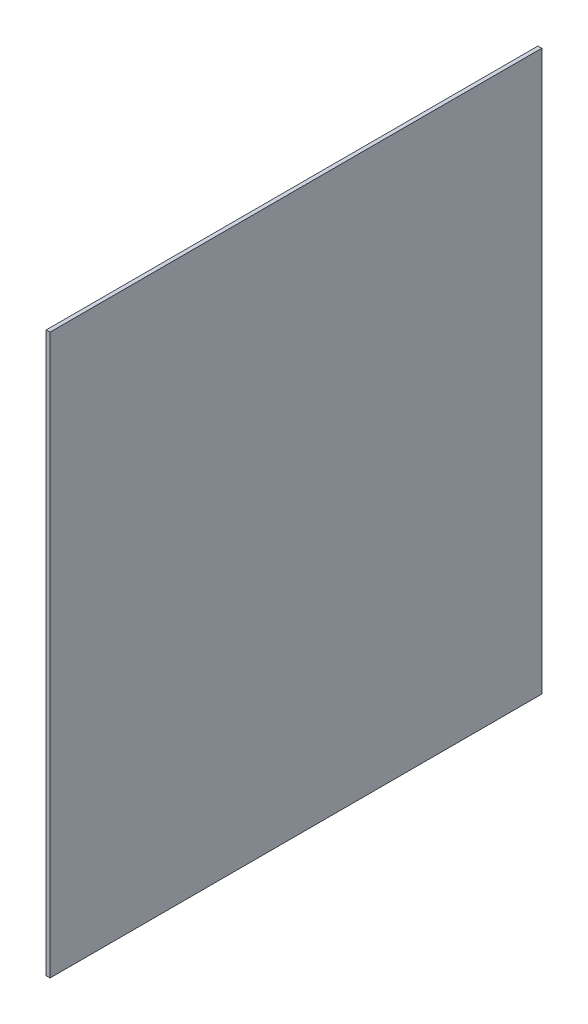
ISO-10303-21;
HEADER;
FILE_DESCRIPTION(('STEP AP214'),'2;1');
FILE_NAME('part.step','',(''),(''),'','','');
FILE_SCHEMA(('AUTOMOTIVE_DESIGN { 1 0 10303 214 1 1 1 1 }'));
ENDSEC;
DATA;
#1=APPLICATION_CONTEXT('core data for automotive mechanical design processes');
#2=APPLICATION_PROTOCOL_DEFINITION('international standard','automotive_design',2000,#1);
#3=PRODUCT_CONTEXT('',#1,'mechanical');
#4=PRODUCT('Part','Part','',(#3));
#5=PRODUCT_RELATED_PRODUCT_CATEGORY('part','',(#4));
#6=PRODUCT_DEFINITION_FORMATION('','',#4);
#7=PRODUCT_DEFINITION_CONTEXT('part definition',#1,'design');
#8=PRODUCT_DEFINITION('design','',#6,#7);
#9=PRODUCT_DEFINITION_SHAPE('','',#8);
#10=(LENGTH_UNIT() NAMED_UNIT(*) SI_UNIT(.MILLI.,.METRE.));
#11=(NAMED_UNIT(*) PLANE_ANGLE_UNIT() SI_UNIT($,.RADIAN.));
#12=(NAMED_UNIT(*) SI_UNIT($,.STERADIAN.) SOLID_ANGLE_UNIT());
#13=UNCERTAINTY_MEASURE_WITH_UNIT(LENGTH_MEASURE(1.E-05),#10,'distance_accuracy_value','');
#14=(GEOMETRIC_REPRESENTATION_CONTEXT(3) GLOBAL_UNCERTAINTY_ASSIGNED_CONTEXT((#13)) GLOBAL_UNIT_ASSIGNED_CONTEXT((#10,
#11,#12)) REPRESENTATION_CONTEXT('',''));
#15=CARTESIAN_POINT('',(0.,0.,0.));
#16=DIRECTION('',(0.,0.,1.));
#17=DIRECTION('',(1.,0.,0.));
#18=AXIS2_PLACEMENT_3D('',#15,#16,#17);
#19=CARTESIAN_POINT('',(1.5875,0.,0.));
#20=DIRECTION('',(0.,0.,-1.));
#21=DIRECTION('',(-1.,0.,0.));
#22=AXIS2_PLACEMENT_3D('',#19,#20,#21);
#23=PLANE('',#22);
#24=DIRECTION('',(0.,-1.,0.));
#25=VECTOR('',#24,1.);
#26=CARTESIAN_POINT('',(0.,0.,0.));
#27=LINE('',#26,#25);
#28=CARTESIAN_POINT('',(0.,231.14,0.));
#29=VERTEX_POINT('',#28);
#30=CARTESIAN_POINT('',(0.,0.,0.));
#31=VERTEX_POINT('',#30);
#32=EDGE_CURVE('E96',#29,#31,#27,.T.);
#33=ORIENTED_EDGE('',*,*,#32,.T.);
#34=DIRECTION('',(-1.,0.,0.));
#35=VECTOR('',#34,1.);
#36=CARTESIAN_POINT('',(1.5875,0.,0.));
#37=LINE('',#36,#35);
#38=CARTESIAN_POINT('',(1.5875,0.,0.));
#39=VERTEX_POINT('',#38);
#40=EDGE_CURVE('E11',#39,#31,#37,.T.);
#41=ORIENTED_EDGE('',*,*,#40,.F.);
#42=DIRECTION('',(0.,-1.,0.));
#43=VECTOR('',#42,1.);
#44=CARTESIAN_POINT('',(1.5875,0.,0.));
#45=LINE('',#44,#43);
#46=CARTESIAN_POINT('',(1.5875,231.14,0.));
#47=VERTEX_POINT('',#46);
#48=EDGE_CURVE('E84',#47,#39,#45,.T.);
#49=ORIENTED_EDGE('',*,*,#48,.F.);
#50=DIRECTION('',(-1.,0.,0.));
#51=VECTOR('',#50,1.);
#52=CARTESIAN_POINT('',(1.5875,231.14,0.));
#53=LINE('',#52,#51);
#54=EDGE_CURVE('E92',#47,#29,#53,.T.);
#55=ORIENTED_EDGE('',*,*,#54,.T.);
#56=EDGE_LOOP('',(#33,#41,#49,#55));
#57=FACE_BOUND('',#56,.T.);
#58=ADVANCED_FACE('F33',(#57),#23,.F.);
#59=CARTESIAN_POINT('',(1.5875,0.,0.));
#60=DIRECTION('',(0.,1.,0.));
#61=DIRECTION('',(0.,0.,1.));
#62=AXIS2_PLACEMENT_3D('',#59,#60,#61);
#63=PLANE('',#62);
#64=DIRECTION('',(0.,0.,-1.));
#65=VECTOR('',#64,1.);
#66=CARTESIAN_POINT('',(0.,0.,0.));
#67=LINE('',#66,#65);
#68=CARTESIAN_POINT('',(0.,0.,-203.2));
#69=VERTEX_POINT('',#68);
#70=EDGE_CURVE('E88',#31,#69,#67,.T.);
#71=ORIENTED_EDGE('',*,*,#70,.T.);
#72=DIRECTION('',(-1.,0.,0.));
#73=VECTOR('',#72,1.);
#74=CARTESIAN_POINT('',(1.5875,0.,-203.2));
#75=LINE('',#74,#73);
#76=CARTESIAN_POINT('',(1.5875,0.,-203.2));
#77=VERTEX_POINT('',#76);
#78=EDGE_CURVE('E41',#77,#69,#75,.T.);
#79=ORIENTED_EDGE('',*,*,#78,.F.);
#80=DIRECTION('',(0.,0.,-1.));
#81=VECTOR('',#80,1.);
#82=CARTESIAN_POINT('',(1.5875,0.,0.));
#83=LINE('',#82,#81);
#84=EDGE_CURVE('E79',#39,#77,#83,.T.);
#85=ORIENTED_EDGE('',*,*,#84,.F.);
#86=ORIENTED_EDGE('',*,*,#40,.T.);
#87=EDGE_LOOP('',(#71,#79,#85,#86));
#88=FACE_BOUND('',#87,.T.);
#89=ADVANCED_FACE('F87',(#88),#63,.F.);
#90=CARTESIAN_POINT('',(1.5875,0.,-203.2));
#91=DIRECTION('',(0.,0.,1.));
#92=DIRECTION('',(1.,0.,0.));
#93=AXIS2_PLACEMENT_3D('',#90,#91,#92);
#94=PLANE('',#93);
#95=DIRECTION('',(0.,1.,0.));
#96=VECTOR('',#95,1.);
#97=CARTESIAN_POINT('',(0.,0.,-203.2));
#98=LINE('',#97,#96);
#99=CARTESIAN_POINT('',(0.,231.14,-203.2));
#100=VERTEX_POINT('',#99);
#101=EDGE_CURVE('E66',#69,#100,#98,.T.);
#102=ORIENTED_EDGE('',*,*,#101,.T.);
#103=DIRECTION('',(-1.,0.,0.));
#104=VECTOR('',#103,1.);
#105=CARTESIAN_POINT('',(1.5875,231.14,-203.2));
#106=LINE('',#105,#104);
#107=CARTESIAN_POINT('',(1.5875,231.14,-203.2));
#108=VERTEX_POINT('',#107);
#109=EDGE_CURVE('E89',#108,#100,#106,.T.);
#110=ORIENTED_EDGE('',*,*,#109,.F.);
#111=DIRECTION('',(0.,1.,0.));
#112=VECTOR('',#111,1.);
#113=CARTESIAN_POINT('',(1.5875,0.,-203.2));
#114=LINE('',#113,#112);
#115=EDGE_CURVE('E82',#77,#108,#114,.T.);
#116=ORIENTED_EDGE('',*,*,#115,.F.);
#117=ORIENTED_EDGE('',*,*,#78,.T.);
#118=EDGE_LOOP('',(#102,#110,#116,#117));
#119=FACE_BOUND('',#118,.T.);
#120=ADVANCED_FACE('F90',(#119),#94,.F.);
#121=CARTESIAN_POINT('',(1.5875,231.14,0.));
#122=DIRECTION('',(0.,-1.,0.));
#123=DIRECTION('',(0.,0.,-1.));
#124=AXIS2_PLACEMENT_3D('',#121,#122,#123);
#125=PLANE('',#124);
#126=DIRECTION('',(0.,0.,1.));
#127=VECTOR('',#126,1.);
#128=CARTESIAN_POINT('',(0.,231.14,0.));
#129=LINE('',#128,#127);
#130=EDGE_CURVE('E72',#100,#29,#129,.T.);
#131=ORIENTED_EDGE('',*,*,#130,.T.);
#132=ORIENTED_EDGE('',*,*,#54,.F.);
#133=DIRECTION('',(0.,0.,1.));
#134=VECTOR('',#133,1.);
#135=CARTESIAN_POINT('',(1.5875,231.14,0.));
#136=LINE('',#135,#134);
#137=EDGE_CURVE('E49',#108,#47,#136,.T.);
#138=ORIENTED_EDGE('',*,*,#137,.F.);
#139=ORIENTED_EDGE('',*,*,#109,.T.);
#140=EDGE_LOOP('',(#131,#132,#138,#139));
#141=FACE_BOUND('',#140,.T.);
#142=ADVANCED_FACE('F103',(#141),#125,.F.);
#143=CARTESIAN_POINT('',(1.5875,0.,0.));
#144=DIRECTION('',(-1.,0.,0.));
#145=DIRECTION('',(0.,0.,1.));
#146=AXIS2_PLACEMENT_3D('',#143,#144,#145);
#147=PLANE('',#146);
#148=ORIENTED_EDGE('',*,*,#48,.T.);
#149=ORIENTED_EDGE('',*,*,#84,.T.);
#150=ORIENTED_EDGE('',*,*,#115,.T.);
#151=ORIENTED_EDGE('',*,*,#137,.T.);
#152=EDGE_LOOP('',(#148,#149,#150,#151));
#153=FACE_BOUND('',#152,.T.);
#154=ADVANCED_FACE('F80',(#153),#147,.F.);
#155=CARTESIAN_POINT('',(0.,0.,0.));
#156=DIRECTION('',(-1.,0.,0.));
#157=DIRECTION('',(0.,0.,1.));
#158=AXIS2_PLACEMENT_3D('',#155,#156,#157);
#159=PLANE('',#158);
#160=ORIENTED_EDGE('',*,*,#32,.F.);
#161=ORIENTED_EDGE('',*,*,#130,.F.);
#162=ORIENTED_EDGE('',*,*,#101,.F.);
#163=ORIENTED_EDGE('',*,*,#70,.F.);
#164=EDGE_LOOP('',(#160,#161,#162,#163));
#165=FACE_BOUND('',#164,.T.);
#166=ADVANCED_FACE('F106',(#165),#159,.T.);
#167=CLOSED_SHELL('',(#58,#89,#120,#142,#154,#166));
#168=MANIFOLD_SOLID_BREP('B2',#167);
#169=ADVANCED_BREP_SHAPE_REPRESENTATION('',(#18,#168),#14);
#170=SHAPE_DEFINITION_REPRESENTATION(#9,#169);
ENDSEC;
END-ISO-10303-21;
